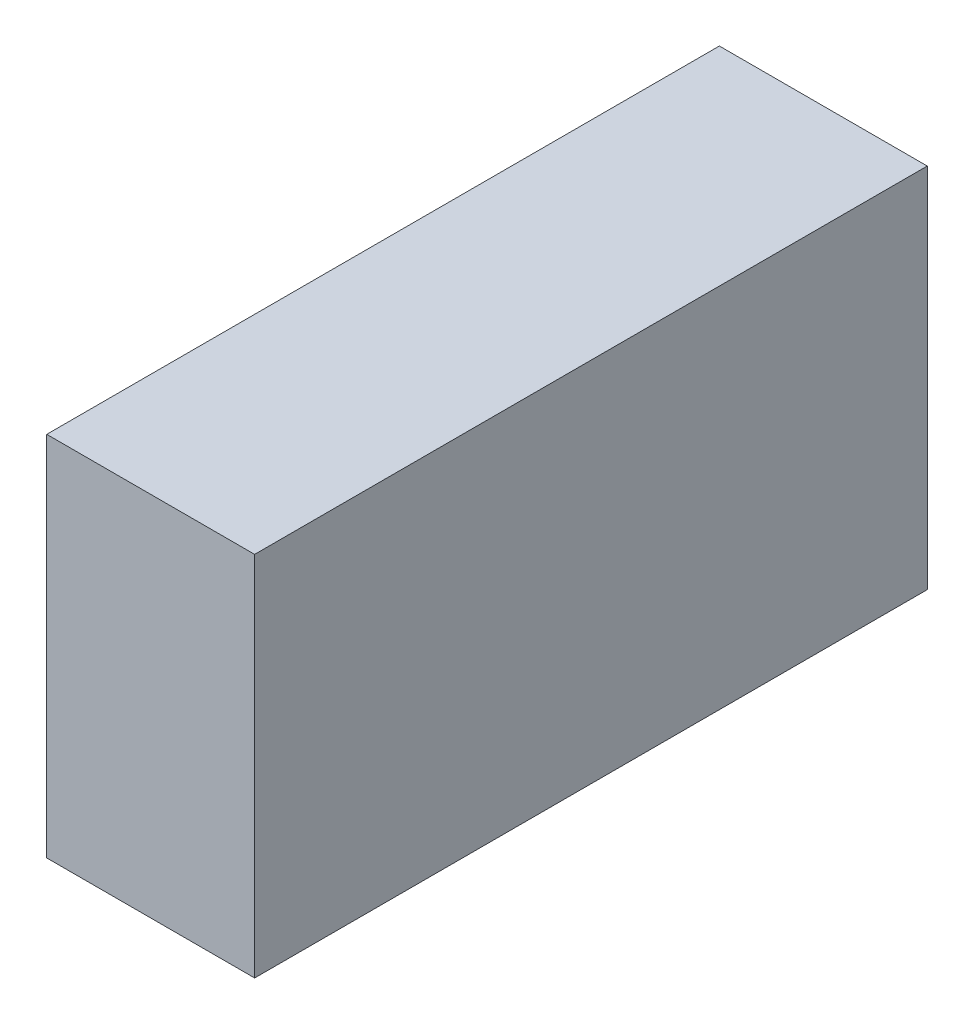
ISO-10303-21;
HEADER;
FILE_DESCRIPTION(('STEP AP214'),'2;1');
FILE_NAME('part.step','',(''),(''),'','','');
FILE_SCHEMA(('AUTOMOTIVE_DESIGN { 1 0 10303 214 1 1 1 1 }'));
ENDSEC;
DATA;
#1=APPLICATION_CONTEXT('core data for automotive mechanical design processes');
#2=APPLICATION_PROTOCOL_DEFINITION('international standard','automotive_design',2000,#1);
#3=PRODUCT_CONTEXT('',#1,'mechanical');
#4=PRODUCT('Part','Part','',(#3));
#5=PRODUCT_RELATED_PRODUCT_CATEGORY('part','',(#4));
#6=PRODUCT_DEFINITION_FORMATION('','',#4);
#7=PRODUCT_DEFINITION_CONTEXT('part definition',#1,'design');
#8=PRODUCT_DEFINITION('design','',#6,#7);
#9=PRODUCT_DEFINITION_SHAPE('','',#8);
#10=(LENGTH_UNIT() NAMED_UNIT(*) SI_UNIT(.MILLI.,.METRE.));
#11=(NAMED_UNIT(*) PLANE_ANGLE_UNIT() SI_UNIT($,.RADIAN.));
#12=(NAMED_UNIT(*) SI_UNIT($,.STERADIAN.) SOLID_ANGLE_UNIT());
#13=UNCERTAINTY_MEASURE_WITH_UNIT(LENGTH_MEASURE(1.E-05),#10,'distance_accuracy_value','');
#14=(GEOMETRIC_REPRESENTATION_CONTEXT(3) GLOBAL_UNCERTAINTY_ASSIGNED_CONTEXT((#13)) GLOBAL_UNIT_ASSIGNED_CONTEXT((#10,
#11,#12)) REPRESENTATION_CONTEXT('',''));
#15=CARTESIAN_POINT('',(0.,0.,0.));
#16=DIRECTION('',(0.,0.,1.));
#17=DIRECTION('',(1.,0.,0.));
#18=AXIS2_PLACEMENT_3D('',#15,#16,#17);
#19=CARTESIAN_POINT('',(-52.2058459736109,-56.3579943067556,7.84563974218704));
#20=DIRECTION('',(1.,0.,0.));
#21=DIRECTION('',(0.,0.,-1.));
#22=AXIS2_PLACEMENT_3D('',#19,#20,#21);
#23=PLANE('',#22);
#24=DIRECTION('',(0.,0.,1.));
#25=VECTOR('',#24,1.);
#26=CARTESIAN_POINT('',(-52.2058459736109,-86.3579943067556,7.84563974218704));
#27=LINE('',#26,#25);
#28=CARTESIAN_POINT('',(-52.2058459736109,-86.3579943067556,7.84563974218704));
#29=VERTEX_POINT('',#28);
#30=CARTESIAN_POINT('',(-52.2058459736109,-86.3579943067556,62.845639742187));
#31=VERTEX_POINT('',#30);
#32=EDGE_CURVE('E102',#29,#31,#27,.T.);
#33=ORIENTED_EDGE('',*,*,#32,.T.);
#34=DIRECTION('',(0.,-1.,0.));
#35=VECTOR('',#34,1.);
#36=CARTESIAN_POINT('',(-52.2058459736109,-56.3579943067556,62.845639742187));
#37=LINE('',#36,#35);
#38=CARTESIAN_POINT('',(-52.2058459736109,-56.3579943067556,62.845639742187));
#39=VERTEX_POINT('',#38);
#40=EDGE_CURVE('E11',#39,#31,#37,.T.);
#41=ORIENTED_EDGE('',*,*,#40,.F.);
#42=DIRECTION('',(0.,0.,1.));
#43=VECTOR('',#42,1.);
#44=CARTESIAN_POINT('',(-52.2058459736109,-56.3579943067556,7.84563974218704));
#45=LINE('',#44,#43);
#46=CARTESIAN_POINT('',(-52.2058459736109,-56.3579943067556,7.84563974218704));
#47=VERTEX_POINT('',#46);
#48=EDGE_CURVE('E90',#47,#39,#45,.T.);
#49=ORIENTED_EDGE('',*,*,#48,.F.);
#50=DIRECTION('',(0.,-1.,0.));
#51=VECTOR('',#50,1.);
#52=CARTESIAN_POINT('',(-52.2058459736109,-56.3579943067556,7.84563974218704));
#53=LINE('',#52,#51);
#54=EDGE_CURVE('E98',#47,#29,#53,.T.);
#55=ORIENTED_EDGE('',*,*,#54,.T.);
#56=EDGE_LOOP('',(#33,#41,#49,#55));
#57=FACE_BOUND('',#56,.T.);
#58=ADVANCED_FACE('F39',(#57),#23,.F.);
#59=CARTESIAN_POINT('',(-52.2058459736109,-56.3579943067556,62.845639742187));
#60=DIRECTION('',(0.,0.,-1.));
#61=DIRECTION('',(-1.,0.,0.));
#62=AXIS2_PLACEMENT_3D('',#59,#60,#61);
#63=PLANE('',#62);
#64=DIRECTION('',(1.,0.,0.));
#65=VECTOR('',#64,1.);
#66=CARTESIAN_POINT('',(-52.2058459736109,-86.3579943067556,62.845639742187));
#67=LINE('',#66,#65);
#68=CARTESIAN_POINT('',(-35.2058459736109,-86.3579943067556,62.845639742187));
#69=VERTEX_POINT('',#68);
#70=EDGE_CURVE('E94',#31,#69,#67,.T.);
#71=ORIENTED_EDGE('',*,*,#70,.T.);
#72=DIRECTION('',(0.,-1.,0.));
#73=VECTOR('',#72,1.);
#74=CARTESIAN_POINT('',(-35.2058459736109,-56.3579943067556,62.845639742187));
#75=LINE('',#74,#73);
#76=CARTESIAN_POINT('',(-35.2058459736109,-56.3579943067556,62.845639742187));
#77=VERTEX_POINT('',#76);
#78=EDGE_CURVE('E47',#77,#69,#75,.T.);
#79=ORIENTED_EDGE('',*,*,#78,.F.);
#80=DIRECTION('',(1.,0.,0.));
#81=VECTOR('',#80,1.);
#82=CARTESIAN_POINT('',(-52.2058459736109,-56.3579943067556,62.845639742187));
#83=LINE('',#82,#81);
#84=EDGE_CURVE('E85',#39,#77,#83,.T.);
#85=ORIENTED_EDGE('',*,*,#84,.F.);
#86=ORIENTED_EDGE('',*,*,#40,.T.);
#87=EDGE_LOOP('',(#71,#79,#85,#86));
#88=FACE_BOUND('',#87,.T.);
#89=ADVANCED_FACE('F93',(#88),#63,.F.);
#90=CARTESIAN_POINT('',(-35.2058459736109,-56.3579943067556,7.84563974218704));
#91=DIRECTION('',(-1.,0.,0.));
#92=DIRECTION('',(0.,0.,1.));
#93=AXIS2_PLACEMENT_3D('',#90,#91,#92);
#94=PLANE('',#93);
#95=DIRECTION('',(0.,0.,-1.));
#96=VECTOR('',#95,1.);
#97=CARTESIAN_POINT('',(-35.2058459736109,-86.3579943067556,7.84563974218704));
#98=LINE('',#97,#96);
#99=CARTESIAN_POINT('',(-35.2058459736109,-86.3579943067556,7.84563974218704));
#100=VERTEX_POINT('',#99);
#101=EDGE_CURVE('E72',#69,#100,#98,.T.);
#102=ORIENTED_EDGE('',*,*,#101,.T.);
#103=DIRECTION('',(0.,-1.,0.));
#104=VECTOR('',#103,1.);
#105=CARTESIAN_POINT('',(-35.2058459736109,-56.3579943067556,7.84563974218704));
#106=LINE('',#105,#104);
#107=CARTESIAN_POINT('',(-35.2058459736109,-56.3579943067556,7.84563974218704));
#108=VERTEX_POINT('',#107);
#109=EDGE_CURVE('E95',#108,#100,#106,.T.);
#110=ORIENTED_EDGE('',*,*,#109,.F.);
#111=DIRECTION('',(0.,0.,-1.));
#112=VECTOR('',#111,1.);
#113=CARTESIAN_POINT('',(-35.2058459736109,-56.3579943067556,7.84563974218704));
#114=LINE('',#113,#112);
#115=EDGE_CURVE('E88',#77,#108,#114,.T.);
#116=ORIENTED_EDGE('',*,*,#115,.F.);
#117=ORIENTED_EDGE('',*,*,#78,.T.);
#118=EDGE_LOOP('',(#102,#110,#116,#117));
#119=FACE_BOUND('',#118,.T.);
#120=ADVANCED_FACE('F96',(#119),#94,.F.);
#121=CARTESIAN_POINT('',(-52.2058459736109,-56.3579943067556,7.84563974218704));
#122=DIRECTION('',(0.,0.,1.));
#123=DIRECTION('',(1.,0.,0.));
#124=AXIS2_PLACEMENT_3D('',#121,#122,#123);
#125=PLANE('',#124);
#126=DIRECTION('',(-1.,0.,0.));
#127=VECTOR('',#126,1.);
#128=CARTESIAN_POINT('',(-52.2058459736109,-86.3579943067556,7.84563974218704));
#129=LINE('',#128,#127);
#130=EDGE_CURVE('E78',#100,#29,#129,.T.);
#131=ORIENTED_EDGE('',*,*,#130,.T.);
#132=ORIENTED_EDGE('',*,*,#54,.F.);
#133=DIRECTION('',(-1.,0.,0.));
#134=VECTOR('',#133,1.);
#135=CARTESIAN_POINT('',(-52.2058459736109,-56.3579943067556,7.84563974218704));
#136=LINE('',#135,#134);
#137=EDGE_CURVE('E55',#108,#47,#136,.T.);
#138=ORIENTED_EDGE('',*,*,#137,.F.);
#139=ORIENTED_EDGE('',*,*,#109,.T.);
#140=EDGE_LOOP('',(#131,#132,#138,#139));
#141=FACE_BOUND('',#140,.T.);
#142=ADVANCED_FACE('F109',(#141),#125,.F.);
#143=CARTESIAN_POINT('',(0.,-56.3579943067556,0.));
#144=DIRECTION('',(0.,1.,0.));
#145=DIRECTION('',(0.,0.,1.));
#146=AXIS2_PLACEMENT_3D('',#143,#144,#145);
#147=PLANE('',#146);
#148=ORIENTED_EDGE('',*,*,#48,.T.);
#149=ORIENTED_EDGE('',*,*,#84,.T.);
#150=ORIENTED_EDGE('',*,*,#115,.T.);
#151=ORIENTED_EDGE('',*,*,#137,.T.);
#152=EDGE_LOOP('',(#148,#149,#150,#151));
#153=FACE_BOUND('',#152,.T.);
#154=ADVANCED_FACE('F86',(#153),#147,.T.);
#155=CARTESIAN_POINT('',(0.,-86.3579943067556,0.));
#156=DIRECTION('',(0.,1.,0.));
#157=DIRECTION('',(0.,0.,1.));
#158=AXIS2_PLACEMENT_3D('',#155,#156,#157);
#159=PLANE('',#158);
#160=ORIENTED_EDGE('',*,*,#32,.F.);
#161=ORIENTED_EDGE('',*,*,#130,.F.);
#162=ORIENTED_EDGE('',*,*,#101,.F.);
#163=ORIENTED_EDGE('',*,*,#70,.F.);
#164=EDGE_LOOP('',(#160,#161,#162,#163));
#165=FACE_BOUND('',#164,.T.);
#166=ADVANCED_FACE('F112',(#165),#159,.F.);
#167=CLOSED_SHELL('',(#58,#89,#120,#142,#154,#166));
#168=MANIFOLD_SOLID_BREP('B2',#167);
#169=ADVANCED_BREP_SHAPE_REPRESENTATION('',(#18,#168),#14);
#170=SHAPE_DEFINITION_REPRESENTATION(#9,#169);
ENDSEC;
END-ISO-10303-21;
